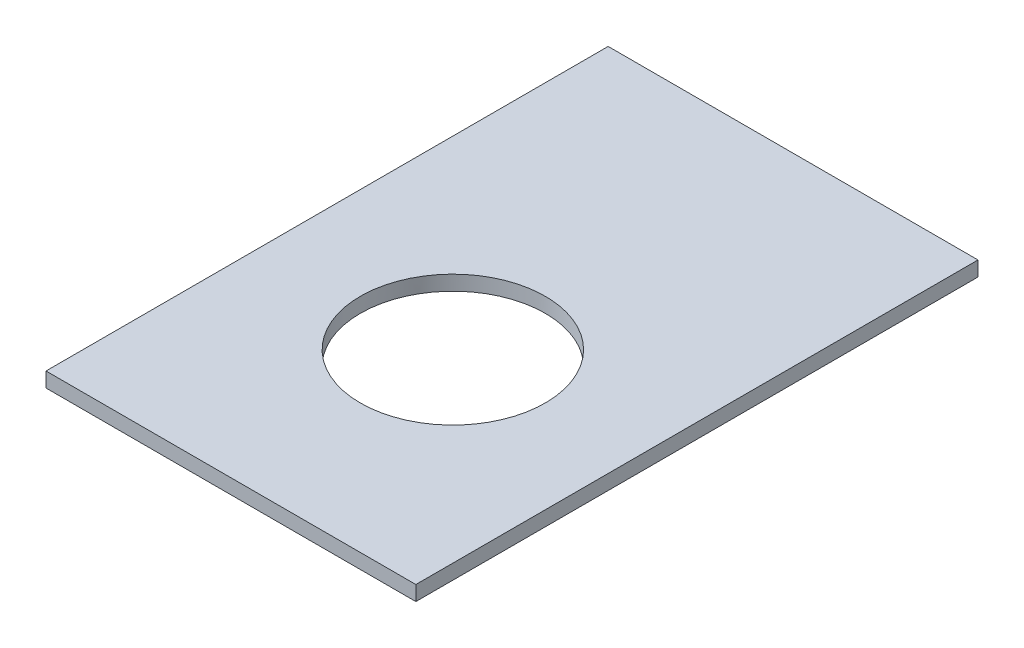
ISO-10303-21;
HEADER;
FILE_DESCRIPTION(('STEP AP214'),'2;1');
FILE_NAME('part.step','',(''),(''),'','','');
FILE_SCHEMA(('AUTOMOTIVE_DESIGN { 1 0 10303 214 1 1 1 1 }'));
ENDSEC;
DATA;
#1=APPLICATION_CONTEXT('core data for automotive mechanical design processes');
#2=APPLICATION_PROTOCOL_DEFINITION('international standard','automotive_design',2000,#1);
#3=PRODUCT_CONTEXT('',#1,'mechanical');
#4=PRODUCT('Part','Part','',(#3));
#5=PRODUCT_RELATED_PRODUCT_CATEGORY('part','',(#4));
#6=PRODUCT_DEFINITION_FORMATION('','',#4);
#7=PRODUCT_DEFINITION_CONTEXT('part definition',#1,'design');
#8=PRODUCT_DEFINITION('design','',#6,#7);
#9=PRODUCT_DEFINITION_SHAPE('','',#8);
#10=(LENGTH_UNIT() NAMED_UNIT(*) SI_UNIT(.MILLI.,.METRE.));
#11=(NAMED_UNIT(*) PLANE_ANGLE_UNIT() SI_UNIT($,.RADIAN.));
#12=(NAMED_UNIT(*) SI_UNIT($,.STERADIAN.) SOLID_ANGLE_UNIT());
#13=UNCERTAINTY_MEASURE_WITH_UNIT(LENGTH_MEASURE(1.E-05),#10,'distance_accuracy_value','');
#14=(GEOMETRIC_REPRESENTATION_CONTEXT(3) GLOBAL_UNCERTAINTY_ASSIGNED_CONTEXT((#13)) GLOBAL_UNIT_ASSIGNED_CONTEXT((#10,
#11,#12)) REPRESENTATION_CONTEXT('',''));
#15=CARTESIAN_POINT('',(0.,0.,0.));
#16=DIRECTION('',(0.,0.,1.));
#17=DIRECTION('',(1.,0.,0.));
#18=AXIS2_PLACEMENT_3D('',#15,#16,#17);
#19=CARTESIAN_POINT('',(250.,20.,380.));
#20=DIRECTION('',(-1.,0.,0.));
#21=DIRECTION('',(0.,0.,1.));
#22=AXIS2_PLACEMENT_3D('',#19,#20,#21);
#23=PLANE('',#22);
#24=DIRECTION('',(0.,0.,-1.));
#25=VECTOR('',#24,1.);
#26=CARTESIAN_POINT('',(250.,0.,380.));
#27=LINE('',#26,#25);
#28=CARTESIAN_POINT('',(250.,0.,380.));
#29=VERTEX_POINT('',#28);
#30=CARTESIAN_POINT('',(250.,0.,-380.));
#31=VERTEX_POINT('',#30);
#32=EDGE_CURVE('E95',#29,#31,#27,.T.);
#33=ORIENTED_EDGE('',*,*,#32,.T.);
#34=DIRECTION('',(0.,-1.,0.));
#35=VECTOR('',#34,1.);
#36=CARTESIAN_POINT('',(250.,20.,-380.));
#37=LINE('',#36,#35);
#38=CARTESIAN_POINT('',(250.,20.,-380.));
#39=VERTEX_POINT('',#38);
#40=EDGE_CURVE('E11',#39,#31,#37,.T.);
#41=ORIENTED_EDGE('',*,*,#40,.F.);
#42=DIRECTION('',(0.,0.,-1.));
#43=VECTOR('',#42,1.);
#44=CARTESIAN_POINT('',(250.,20.,380.));
#45=LINE('',#44,#43);
#46=CARTESIAN_POINT('',(250.,20.,380.));
#47=VERTEX_POINT('',#46);
#48=EDGE_CURVE('E83',#47,#39,#45,.T.);
#49=ORIENTED_EDGE('',*,*,#48,.F.);
#50=DIRECTION('',(0.,-1.,0.));
#51=VECTOR('',#50,1.);
#52=CARTESIAN_POINT('',(250.,20.,380.));
#53=LINE('',#52,#51);
#54=EDGE_CURVE('E91',#47,#29,#53,.T.);
#55=ORIENTED_EDGE('',*,*,#54,.T.);
#56=EDGE_LOOP('',(#33,#41,#49,#55));
#57=FACE_BOUND('',#56,.T.);
#58=ADVANCED_FACE('F32',(#57),#23,.F.);
#59=CARTESIAN_POINT('',(-250.,20.,-380.));
#60=DIRECTION('',(0.,0.,1.));
#61=DIRECTION('',(1.,0.,0.));
#62=AXIS2_PLACEMENT_3D('',#59,#60,#61);
#63=PLANE('',#62);
#64=DIRECTION('',(-1.,0.,0.));
#65=VECTOR('',#64,1.);
#66=CARTESIAN_POINT('',(-250.,0.,-380.));
#67=LINE('',#66,#65);
#68=CARTESIAN_POINT('',(-250.,0.,-380.));
#69=VERTEX_POINT('',#68);
#70=EDGE_CURVE('E87',#31,#69,#67,.T.);
#71=ORIENTED_EDGE('',*,*,#70,.T.);
#72=DIRECTION('',(0.,-1.,0.));
#73=VECTOR('',#72,1.);
#74=CARTESIAN_POINT('',(-250.,20.,-380.));
#75=LINE('',#74,#73);
#76=CARTESIAN_POINT('',(-250.,20.,-380.));
#77=VERTEX_POINT('',#76);
#78=EDGE_CURVE('E40',#77,#69,#75,.T.);
#79=ORIENTED_EDGE('',*,*,#78,.F.);
#80=DIRECTION('',(-1.,0.,0.));
#81=VECTOR('',#80,1.);
#82=CARTESIAN_POINT('',(-250.,20.,-380.));
#83=LINE('',#82,#81);
#84=EDGE_CURVE('E78',#39,#77,#83,.T.);
#85=ORIENTED_EDGE('',*,*,#84,.F.);
#86=ORIENTED_EDGE('',*,*,#40,.T.);
#87=EDGE_LOOP('',(#71,#79,#85,#86));
#88=FACE_BOUND('',#87,.T.);
#89=ADVANCED_FACE('F86',(#88),#63,.F.);
#90=CARTESIAN_POINT('',(-250.,20.,380.));
#91=DIRECTION('',(1.,0.,0.));
#92=DIRECTION('',(0.,0.,-1.));
#93=AXIS2_PLACEMENT_3D('',#90,#91,#92);
#94=PLANE('',#93);
#95=DIRECTION('',(0.,0.,1.));
#96=VECTOR('',#95,1.);
#97=CARTESIAN_POINT('',(-250.,0.,380.));
#98=LINE('',#97,#96);
#99=CARTESIAN_POINT('',(-250.,0.,380.));
#100=VERTEX_POINT('',#99);
#101=EDGE_CURVE('E65',#69,#100,#98,.T.);
#102=ORIENTED_EDGE('',*,*,#101,.T.);
#103=DIRECTION('',(0.,-1.,0.));
#104=VECTOR('',#103,1.);
#105=CARTESIAN_POINT('',(-250.,20.,380.));
#106=LINE('',#105,#104);
#107=CARTESIAN_POINT('',(-250.,20.,380.));
#108=VERTEX_POINT('',#107);
#109=EDGE_CURVE('E88',#108,#100,#106,.T.);
#110=ORIENTED_EDGE('',*,*,#109,.F.);
#111=DIRECTION('',(0.,0.,1.));
#112=VECTOR('',#111,1.);
#113=CARTESIAN_POINT('',(-250.,20.,380.));
#114=LINE('',#113,#112);
#115=EDGE_CURVE('E81',#77,#108,#114,.T.);
#116=ORIENTED_EDGE('',*,*,#115,.F.);
#117=ORIENTED_EDGE('',*,*,#78,.T.);
#118=EDGE_LOOP('',(#102,#110,#116,#117));
#119=FACE_BOUND('',#118,.T.);
#120=ADVANCED_FACE('F89',(#119),#94,.F.);
#121=CARTESIAN_POINT('',(-250.,20.,380.));
#122=DIRECTION('',(0.,0.,-1.));
#123=DIRECTION('',(-1.,0.,0.));
#124=AXIS2_PLACEMENT_3D('',#121,#122,#123);
#125=PLANE('',#124);
#126=DIRECTION('',(1.,0.,0.));
#127=VECTOR('',#126,1.);
#128=CARTESIAN_POINT('',(-250.,0.,380.));
#129=LINE('',#128,#127);
#130=EDGE_CURVE('E71',#100,#29,#129,.T.);
#131=ORIENTED_EDGE('',*,*,#130,.T.);
#132=ORIENTED_EDGE('',*,*,#54,.F.);
#133=DIRECTION('',(1.,0.,0.));
#134=VECTOR('',#133,1.);
#135=CARTESIAN_POINT('',(-250.,20.,380.));
#136=LINE('',#135,#134);
#137=EDGE_CURVE('E48',#108,#47,#136,.T.);
#138=ORIENTED_EDGE('',*,*,#137,.F.);
#139=ORIENTED_EDGE('',*,*,#109,.T.);
#140=EDGE_LOOP('',(#131,#132,#138,#139));
#141=FACE_BOUND('',#140,.T.);
#142=ADVANCED_FACE('F103',(#141),#125,.F.);
#143=CARTESIAN_POINT('',(0.,20.,0.));
#144=DIRECTION('',(0.,-1.,0.));
#145=DIRECTION('',(0.,0.,-1.));
#146=AXIS2_PLACEMENT_3D('',#143,#144,#145);
#147=PLANE('',#146);
#148=CARTESIAN_POINT('',(1.66533453693773E-13,20.,80.0000000000001));
#149=DIRECTION('',(0.,1.,0.));
#150=DIRECTION('',(0.,0.,1.));
#151=AXIS2_PLACEMENT_3D('',#148,#149,#150);
#152=CIRCLE('',#151,125.);
#153=CARTESIAN_POINT('',(1.66533453693773E-13,20.,205.));
#154=VERTEX_POINT('',#153);
#155=EDGE_CURVE('E98',#154,#154,#152,.T.);
#156=ORIENTED_EDGE('',*,*,#155,.F.);
#157=EDGE_LOOP('',(#156));
#158=FACE_BOUND('',#157,.T.);
#159=ORIENTED_EDGE('',*,*,#48,.T.);
#160=ORIENTED_EDGE('',*,*,#84,.T.);
#161=ORIENTED_EDGE('',*,*,#115,.T.);
#162=ORIENTED_EDGE('',*,*,#137,.T.);
#163=EDGE_LOOP('',(#159,#160,#161,#162));
#164=FACE_BOUND('',#163,.T.);
#165=ADVANCED_FACE('F79',(#158,#164),#147,.F.);
#166=CARTESIAN_POINT('',(0.,0.,0.));
#167=DIRECTION('',(0.,-1.,0.));
#168=DIRECTION('',(0.,0.,-1.));
#169=AXIS2_PLACEMENT_3D('',#166,#167,#168);
#170=PLANE('',#169);
#171=CARTESIAN_POINT('',(1.66533453693773E-13,0.,80.0000000000001));
#172=DIRECTION('',(0.,-1.,0.));
#173=DIRECTION('',(0.,0.,-1.));
#174=AXIS2_PLACEMENT_3D('',#171,#172,#173);
#175=CIRCLE('',#174,125.);
#176=CARTESIAN_POINT('',(1.66533453693773E-13,0.,-44.9999999999999));
#177=VERTEX_POINT('',#176);
#178=EDGE_CURVE('E109',#177,#177,#175,.F.);
#179=ORIENTED_EDGE('',*,*,#178,.T.);
#180=EDGE_LOOP('',(#179));
#181=FACE_BOUND('',#180,.T.);
#182=ORIENTED_EDGE('',*,*,#32,.F.);
#183=ORIENTED_EDGE('',*,*,#130,.F.);
#184=ORIENTED_EDGE('',*,*,#101,.F.);
#185=ORIENTED_EDGE('',*,*,#70,.F.);
#186=EDGE_LOOP('',(#182,#183,#184,#185));
#187=FACE_BOUND('',#186,.T.);
#188=ADVANCED_FACE('F106',(#181,#187),#170,.T.);
#189=CARTESIAN_POINT('',(1.66533453693773E-13,-0.001000000000001,80.0000000000001));
#190=DIRECTION('',(0.,1.,0.));
#191=DIRECTION('',(0.,0.,1.));
#192=AXIS2_PLACEMENT_3D('',#189,#190,#191);
#193=CYLINDRICAL_SURFACE('',#192,125.);
#194=ORIENTED_EDGE('',*,*,#178,.F.);
#195=EDGE_LOOP('',(#194));
#196=FACE_BOUND('',#195,.T.);
#197=ORIENTED_EDGE('',*,*,#155,.T.);
#198=EDGE_LOOP('',(#197));
#199=FACE_BOUND('',#198,.T.);
#200=ADVANCED_FACE('F115',(#196,#199),#193,.F.);
#201=CLOSED_SHELL('',(#58,#89,#120,#142,#165,#188,#200));
#202=MANIFOLD_SOLID_BREP('B2',#201);
#203=ADVANCED_BREP_SHAPE_REPRESENTATION('',(#18,#202),#14);
#204=SHAPE_DEFINITION_REPRESENTATION(#9,#203);
ENDSEC;
END-ISO-10303-21;
